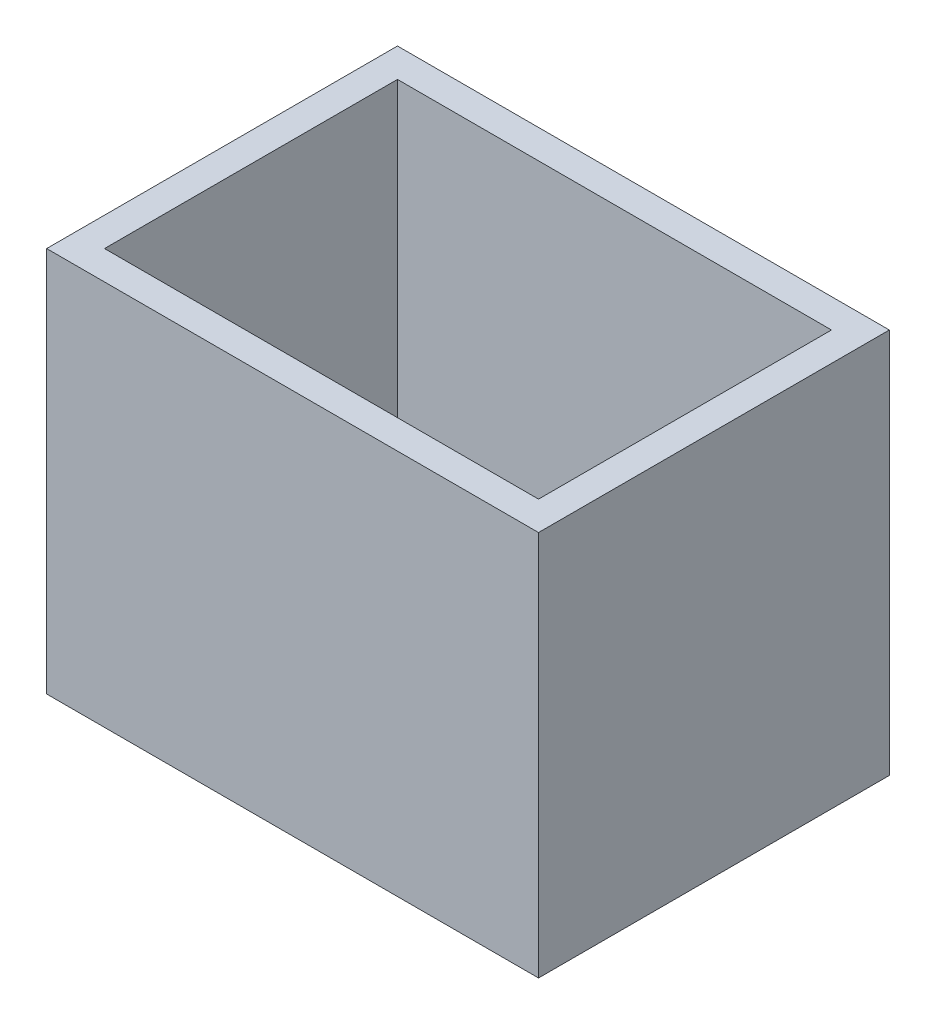
ISO-10303-21;
HEADER;
FILE_DESCRIPTION(('STEP AP214'),'2;1');
FILE_NAME('part.step','',(''),(''),'','','');
FILE_SCHEMA(('AUTOMOTIVE_DESIGN { 1 0 10303 214 1 1 1 1 }'));
ENDSEC;
DATA;
#1=APPLICATION_CONTEXT('core data for automotive mechanical design processes');
#2=APPLICATION_PROTOCOL_DEFINITION('international standard','automotive_design',2000,#1);
#3=PRODUCT_CONTEXT('',#1,'mechanical');
#4=PRODUCT('Part','Part','',(#3));
#5=PRODUCT_RELATED_PRODUCT_CATEGORY('part','',(#4));
#6=PRODUCT_DEFINITION_FORMATION('','',#4);
#7=PRODUCT_DEFINITION_CONTEXT('part definition',#1,'design');
#8=PRODUCT_DEFINITION('design','',#6,#7);
#9=PRODUCT_DEFINITION_SHAPE('','',#8);
#10=(LENGTH_UNIT() NAMED_UNIT(*) SI_UNIT(.MILLI.,.METRE.));
#11=(NAMED_UNIT(*) PLANE_ANGLE_UNIT() SI_UNIT($,.RADIAN.));
#12=(NAMED_UNIT(*) SI_UNIT($,.STERADIAN.) SOLID_ANGLE_UNIT());
#13=UNCERTAINTY_MEASURE_WITH_UNIT(LENGTH_MEASURE(1.E-05),#10,'distance_accuracy_value','');
#14=(GEOMETRIC_REPRESENTATION_CONTEXT(3) GLOBAL_UNCERTAINTY_ASSIGNED_CONTEXT((#13)) GLOBAL_UNIT_ASSIGNED_CONTEXT((#10,
#11,#12)) REPRESENTATION_CONTEXT('',''));
#15=CARTESIAN_POINT('',(0.,0.,0.));
#16=DIRECTION('',(0.,0.,1.));
#17=DIRECTION('',(1.,0.,0.));
#18=AXIS2_PLACEMENT_3D('',#15,#16,#17);
#19=CARTESIAN_POINT('',(0.,-2000.,-240.));
#20=DIRECTION('',(0.,0.,-1.));
#21=DIRECTION('',(-1.,0.,0.));
#22=AXIS2_PLACEMENT_3D('',#19,#20,#21);
#23=PLANE('',#22);
#24=DIRECTION('',(0.,1.,0.));
#25=VECTOR('',#24,1.);
#26=CARTESIAN_POINT('',(-240.,-2000.,-240.));
#27=LINE('',#26,#25);
#28=CARTESIAN_POINT('',(-240.,-2000.,-240.));
#29=VERTEX_POINT('',#28);
#30=CARTESIAN_POINT('',(-240.,1200.,-240.));
#31=VERTEX_POINT('',#30);
#32=EDGE_CURVE('E86',#29,#31,#27,.T.);
#33=ORIENTED_EDGE('',*,*,#32,.T.);
#34=DIRECTION('',(-1.,0.,0.));
#35=VECTOR('',#34,1.);
#36=CARTESIAN_POINT('',(0.,1200.,-240.));
#37=LINE('',#36,#35);
#38=CARTESIAN_POINT('',(3840.,1200.,-240.));
#39=VERTEX_POINT('',#38);
#40=EDGE_CURVE('E178',#39,#31,#37,.T.);
#41=ORIENTED_EDGE('',*,*,#40,.F.);
#42=DIRECTION('',(0.,1.,0.));
#43=VECTOR('',#42,1.);
#44=CARTESIAN_POINT('',(3840.,-2000.,-240.));
#45=LINE('',#44,#43);
#46=CARTESIAN_POINT('',(3840.,-2000.,-240.));
#47=VERTEX_POINT('',#46);
#48=EDGE_CURVE('E12',#47,#39,#45,.T.);
#49=ORIENTED_EDGE('',*,*,#48,.F.);
#50=DIRECTION('',(-1.,0.,0.));
#51=VECTOR('',#50,1.);
#52=CARTESIAN_POINT('',(0.,-2000.,-240.));
#53=LINE('',#52,#51);
#54=EDGE_CURVE('E197',#47,#29,#53,.T.);
#55=ORIENTED_EDGE('',*,*,#54,.T.);
#56=EDGE_LOOP('',(#33,#41,#49,#55));
#57=FACE_BOUND('',#56,.T.);
#58=ADVANCED_FACE('F83',(#57),#23,.T.);
#59=CARTESIAN_POINT('',(3840.,-2000.,-7.01770603219852E-13));
#60=DIRECTION('',(1.,0.,0.));
#61=DIRECTION('',(0.,0.,-1.));
#62=AXIS2_PLACEMENT_3D('',#59,#60,#61);
#63=PLANE('',#62);
#64=ORIENTED_EDGE('',*,*,#48,.T.);
#65=DIRECTION('',(0.,0.,-1.));
#66=VECTOR('',#65,1.);
#67=CARTESIAN_POINT('',(3840.,1200.,-7.01770603219852E-13));
#68=LINE('',#67,#66);
#69=CARTESIAN_POINT('',(3840.,1200.,2670.));
#70=VERTEX_POINT('',#69);
#71=EDGE_CURVE('E187',#70,#39,#68,.T.);
#72=ORIENTED_EDGE('',*,*,#71,.F.);
#73=DIRECTION('',(0.,1.,0.));
#74=VECTOR('',#73,1.);
#75=CARTESIAN_POINT('',(3840.,-2000.,2670.));
#76=LINE('',#75,#74);
#77=CARTESIAN_POINT('',(3840.,-2000.,2670.));
#78=VERTEX_POINT('',#77);
#79=EDGE_CURVE('E91',#78,#70,#76,.T.);
#80=ORIENTED_EDGE('',*,*,#79,.F.);
#81=DIRECTION('',(0.,0.,-1.));
#82=VECTOR('',#81,1.);
#83=CARTESIAN_POINT('',(3840.,-2000.,-7.01770603219852E-13));
#84=LINE('',#83,#82);
#85=EDGE_CURVE('E208',#78,#47,#84,.T.);
#86=ORIENTED_EDGE('',*,*,#85,.T.);
#87=EDGE_LOOP('',(#64,#72,#80,#86));
#88=FACE_BOUND('',#87,.T.);
#89=ADVANCED_FACE('F220',(#88),#63,.T.);
#90=CARTESIAN_POINT('',(0.,-2000.,2670.));
#91=DIRECTION('',(0.,0.,1.));
#92=DIRECTION('',(1.,0.,0.));
#93=AXIS2_PLACEMENT_3D('',#90,#91,#92);
#94=PLANE('',#93);
#95=ORIENTED_EDGE('',*,*,#79,.T.);
#96=DIRECTION('',(1.,0.,0.));
#97=VECTOR('',#96,1.);
#98=CARTESIAN_POINT('',(0.,1200.,2670.));
#99=LINE('',#98,#97);
#100=CARTESIAN_POINT('',(-240.,1200.,2670.));
#101=VERTEX_POINT('',#100);
#102=EDGE_CURVE('E184',#101,#70,#99,.T.);
#103=ORIENTED_EDGE('',*,*,#102,.F.);
#104=DIRECTION('',(0.,1.,0.));
#105=VECTOR('',#104,1.);
#106=CARTESIAN_POINT('',(-240.,-2000.,2670.));
#107=LINE('',#106,#105);
#108=CARTESIAN_POINT('',(-240.,-2000.,2670.));
#109=VERTEX_POINT('',#108);
#110=EDGE_CURVE('E211',#109,#101,#107,.T.);
#111=ORIENTED_EDGE('',*,*,#110,.F.);
#112=DIRECTION('',(1.,0.,0.));
#113=VECTOR('',#112,1.);
#114=CARTESIAN_POINT('',(0.,-2000.,2670.));
#115=LINE('',#114,#113);
#116=EDGE_CURVE('E205',#109,#78,#115,.T.);
#117=ORIENTED_EDGE('',*,*,#116,.T.);
#118=EDGE_LOOP('',(#95,#103,#111,#117));
#119=FACE_BOUND('',#118,.T.);
#120=ADVANCED_FACE('F226',(#119),#94,.T.);
#121=CARTESIAN_POINT('',(-240.,-2000.,0.));
#122=DIRECTION('',(-1.,0.,0.));
#123=DIRECTION('',(0.,0.,1.));
#124=AXIS2_PLACEMENT_3D('',#121,#122,#123);
#125=PLANE('',#124);
#126=ORIENTED_EDGE('',*,*,#110,.T.);
#127=DIRECTION('',(0.,0.,1.));
#128=VECTOR('',#127,1.);
#129=CARTESIAN_POINT('',(-240.,1200.,0.));
#130=LINE('',#129,#128);
#131=EDGE_CURVE('E181',#31,#101,#130,.T.);
#132=ORIENTED_EDGE('',*,*,#131,.F.);
#133=ORIENTED_EDGE('',*,*,#32,.F.);
#134=DIRECTION('',(0.,0.,1.));
#135=VECTOR('',#134,1.);
#136=CARTESIAN_POINT('',(-240.,-2000.,0.));
#137=LINE('',#136,#135);
#138=EDGE_CURVE('E202',#29,#109,#137,.T.);
#139=ORIENTED_EDGE('',*,*,#138,.T.);
#140=EDGE_LOOP('',(#126,#132,#133,#139));
#141=FACE_BOUND('',#140,.T.);
#142=ADVANCED_FACE('F215',(#141),#125,.T.);
#143=CARTESIAN_POINT('',(0.,-2000.,0.));
#144=DIRECTION('',(0.,1.,0.));
#145=DIRECTION('',(0.,0.,1.));
#146=AXIS2_PLACEMENT_3D('',#143,#144,#145);
#147=PLANE('',#146);
#148=DIRECTION('',(0.,0.,-1.));
#149=VECTOR('',#148,1.);
#150=CARTESIAN_POINT('',(3600.,-2000.,0.));
#151=LINE('',#150,#149);
#152=CARTESIAN_POINT('',(3600.,-2000.,2430.));
#153=VERTEX_POINT('',#152);
#154=CARTESIAN_POINT('',(3600.,-2000.,0.));
#155=VERTEX_POINT('',#154);
#156=EDGE_CURVE('E160',#153,#155,#151,.T.);
#157=ORIENTED_EDGE('',*,*,#156,.T.);
#158=DIRECTION('',(-1.,0.,0.));
#159=VECTOR('',#158,1.);
#160=CARTESIAN_POINT('',(0.,-2000.,0.));
#161=LINE('',#160,#159);
#162=CARTESIAN_POINT('',(0.,-2000.,0.));
#163=VERTEX_POINT('',#162);
#164=EDGE_CURVE('E190',#155,#163,#161,.T.);
#165=ORIENTED_EDGE('',*,*,#164,.T.);
#166=DIRECTION('',(0.,0.,1.));
#167=VECTOR('',#166,1.);
#168=CARTESIAN_POINT('',(0.,-2000.,0.));
#169=LINE('',#168,#167);
#170=CARTESIAN_POINT('',(2.97589172192807E-13,-2000.,2430.));
#171=VERTEX_POINT('',#170);
#172=EDGE_CURVE('E155',#163,#171,#169,.T.);
#173=ORIENTED_EDGE('',*,*,#172,.T.);
#174=DIRECTION('',(1.,0.,0.));
#175=VECTOR('',#174,1.);
#176=CARTESIAN_POINT('',(2.97589172192807E-13,-2000.,2430.));
#177=LINE('',#176,#175);
#178=EDGE_CURVE('E99',#171,#153,#177,.T.);
#179=ORIENTED_EDGE('',*,*,#178,.T.);
#180=EDGE_LOOP('',(#157,#165,#173,#179));
#181=FACE_BOUND('',#180,.T.);
#182=ORIENTED_EDGE('',*,*,#54,.F.);
#183=ORIENTED_EDGE('',*,*,#85,.F.);
#184=ORIENTED_EDGE('',*,*,#116,.F.);
#185=ORIENTED_EDGE('',*,*,#138,.F.);
#186=EDGE_LOOP('',(#182,#183,#184,#185));
#187=FACE_BOUND('',#186,.T.);
#188=ADVANCED_FACE('F224',(#181,#187),#147,.F.);
#189=CARTESIAN_POINT('',(0.,-2000.,0.));
#190=DIRECTION('',(0.,0.,-1.));
#191=DIRECTION('',(-1.,0.,0.));
#192=AXIS2_PLACEMENT_3D('',#189,#190,#191);
#193=PLANE('',#192);
#194=DIRECTION('',(0.,1.,0.));
#195=VECTOR('',#194,1.);
#196=CARTESIAN_POINT('',(3600.,-2000.,0.));
#197=LINE('',#196,#195);
#198=CARTESIAN_POINT('',(3600.,1200.,0.));
#199=VERTEX_POINT('',#198);
#200=EDGE_CURVE('E165',#155,#199,#197,.T.);
#201=ORIENTED_EDGE('',*,*,#200,.T.);
#202=DIRECTION('',(-1.,0.,0.));
#203=VECTOR('',#202,1.);
#204=CARTESIAN_POINT('',(0.,1200.,0.));
#205=LINE('',#204,#203);
#206=CARTESIAN_POINT('',(0.,1200.,0.));
#207=VERTEX_POINT('',#206);
#208=EDGE_CURVE('E163',#199,#207,#205,.T.);
#209=ORIENTED_EDGE('',*,*,#208,.T.);
#210=DIRECTION('',(0.,1.,0.));
#211=VECTOR('',#210,1.);
#212=CARTESIAN_POINT('',(0.,-2000.,0.));
#213=LINE('',#212,#211);
#214=EDGE_CURVE('E148',#163,#207,#213,.T.);
#215=ORIENTED_EDGE('',*,*,#214,.F.);
#216=ORIENTED_EDGE('',*,*,#164,.F.);
#217=EDGE_LOOP('',(#201,#209,#215,#216));
#218=FACE_BOUND('',#217,.T.);
#219=ADVANCED_FACE('F164',(#218),#193,.F.);
#220=CARTESIAN_POINT('',(3600.,-2000.,0.));
#221=DIRECTION('',(1.,0.,0.));
#222=DIRECTION('',(0.,0.,-1.));
#223=AXIS2_PLACEMENT_3D('',#220,#221,#222);
#224=PLANE('',#223);
#225=DIRECTION('',(0.,1.,0.));
#226=VECTOR('',#225,1.);
#227=CARTESIAN_POINT('',(3600.,-2000.,2430.));
#228=LINE('',#227,#226);
#229=CARTESIAN_POINT('',(3600.,1200.,2430.));
#230=VERTEX_POINT('',#229);
#231=EDGE_CURVE('E198',#153,#230,#228,.T.);
#232=ORIENTED_EDGE('',*,*,#231,.T.);
#233=DIRECTION('',(0.,0.,-1.));
#234=VECTOR('',#233,1.);
#235=CARTESIAN_POINT('',(3600.,1200.,0.));
#236=LINE('',#235,#234);
#237=EDGE_CURVE('E174',#230,#199,#236,.T.);
#238=ORIENTED_EDGE('',*,*,#237,.T.);
#239=ORIENTED_EDGE('',*,*,#200,.F.);
#240=ORIENTED_EDGE('',*,*,#156,.F.);
#241=EDGE_LOOP('',(#232,#238,#239,#240));
#242=FACE_BOUND('',#241,.T.);
#243=ADVANCED_FACE('F269',(#242),#224,.F.);
#244=CARTESIAN_POINT('',(2.97589172192807E-13,-2000.,2430.));
#245=DIRECTION('',(0.,0.,1.));
#246=DIRECTION('',(1.,0.,0.));
#247=AXIS2_PLACEMENT_3D('',#244,#245,#246);
#248=PLANE('',#247);
#249=DIRECTION('',(0.,1.,0.));
#250=VECTOR('',#249,1.);
#251=CARTESIAN_POINT('',(2.97589172192807E-13,-2000.,2430.));
#252=LINE('',#251,#250);
#253=CARTESIAN_POINT('',(2.97589172192807E-13,1200.,2430.));
#254=VERTEX_POINT('',#253);
#255=EDGE_CURVE('E159',#171,#254,#252,.T.);
#256=ORIENTED_EDGE('',*,*,#255,.T.);
#257=DIRECTION('',(1.,0.,0.));
#258=VECTOR('',#257,1.);
#259=CARTESIAN_POINT('',(2.97589172192807E-13,1200.,2430.));
#260=LINE('',#259,#258);
#261=EDGE_CURVE('E172',#254,#230,#260,.T.);
#262=ORIENTED_EDGE('',*,*,#261,.T.);
#263=ORIENTED_EDGE('',*,*,#231,.F.);
#264=ORIENTED_EDGE('',*,*,#178,.F.);
#265=EDGE_LOOP('',(#256,#262,#263,#264));
#266=FACE_BOUND('',#265,.T.);
#267=ADVANCED_FACE('F278',(#266),#248,.F.);
#268=CARTESIAN_POINT('',(0.,-2000.,0.));
#269=DIRECTION('',(-1.,0.,0.));
#270=DIRECTION('',(0.,0.,1.));
#271=AXIS2_PLACEMENT_3D('',#268,#269,#270);
#272=PLANE('',#271);
#273=ORIENTED_EDGE('',*,*,#214,.T.);
#274=DIRECTION('',(0.,0.,1.));
#275=VECTOR('',#274,1.);
#276=CARTESIAN_POINT('',(0.,1200.,0.));
#277=LINE('',#276,#275);
#278=EDGE_CURVE('E152',#207,#254,#277,.T.);
#279=ORIENTED_EDGE('',*,*,#278,.T.);
#280=ORIENTED_EDGE('',*,*,#255,.F.);
#281=ORIENTED_EDGE('',*,*,#172,.F.);
#282=EDGE_LOOP('',(#273,#279,#280,#281));
#283=FACE_BOUND('',#282,.T.);
#284=ADVANCED_FACE('F150',(#283),#272,.F.);
#285=CARTESIAN_POINT('',(0.,1200.,0.));
#286=DIRECTION('',(0.,1.,0.));
#287=DIRECTION('',(0.,0.,1.));
#288=AXIS2_PLACEMENT_3D('',#285,#286,#287);
#289=PLANE('',#288);
#290=ORIENTED_EDGE('',*,*,#40,.T.);
#291=ORIENTED_EDGE('',*,*,#131,.T.);
#292=ORIENTED_EDGE('',*,*,#102,.T.);
#293=ORIENTED_EDGE('',*,*,#71,.T.);
#294=EDGE_LOOP('',(#290,#291,#292,#293));
#295=FACE_BOUND('',#294,.T.);
#296=ORIENTED_EDGE('',*,*,#278,.F.);
#297=ORIENTED_EDGE('',*,*,#208,.F.);
#298=ORIENTED_EDGE('',*,*,#237,.F.);
#299=ORIENTED_EDGE('',*,*,#261,.F.);
#300=EDGE_LOOP('',(#296,#297,#298,#299));
#301=FACE_BOUND('',#300,.T.);
#302=ADVANCED_FACE('F170',(#295,#301),#289,.T.);
#303=CLOSED_SHELL('',(#58,#89,#120,#142,#188,#219,#243,#267,#284,#302));
#304=MANIFOLD_SOLID_BREP('B2',#303);
#305=ADVANCED_BREP_SHAPE_REPRESENTATION('',(#18,#304),#14);
#306=SHAPE_DEFINITION_REPRESENTATION(#9,#305);
ENDSEC;
END-ISO-10303-21;
